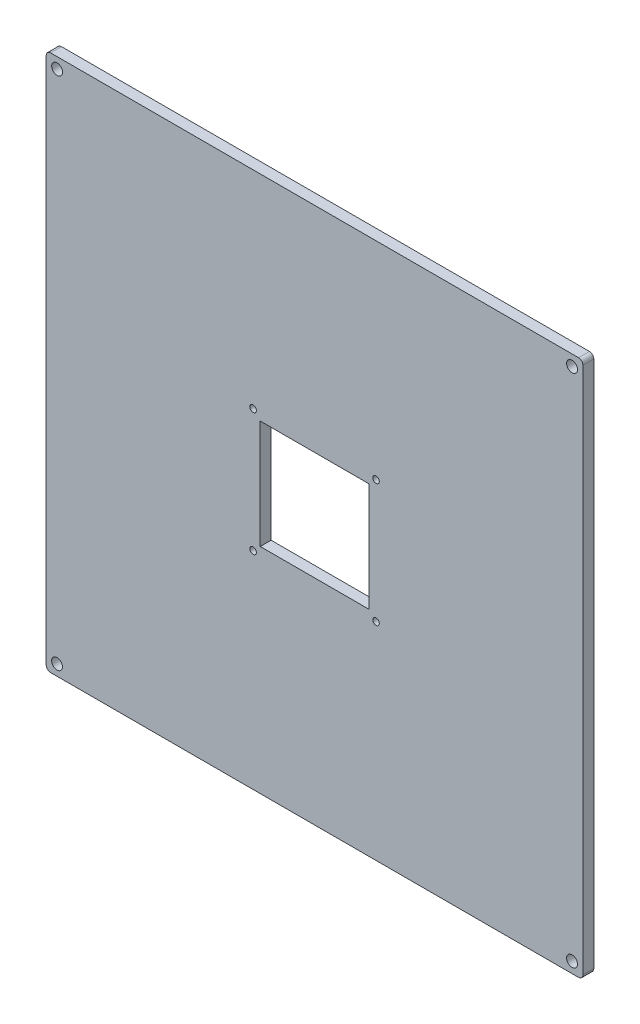
ISO-10303-21;
HEADER;
FILE_DESCRIPTION(('STEP AP214'),'2;1');
FILE_NAME('part.step','',(''),(''),'','','');
FILE_SCHEMA(('AUTOMOTIVE_DESIGN { 1 0 10303 214 1 1 1 1 }'));
ENDSEC;
DATA;
#1=APPLICATION_CONTEXT('core data for automotive mechanical design processes');
#2=APPLICATION_PROTOCOL_DEFINITION('international standard','automotive_design',2000,#1);
#3=PRODUCT_CONTEXT('',#1,'mechanical');
#4=PRODUCT('Part','Part','',(#3));
#5=PRODUCT_RELATED_PRODUCT_CATEGORY('part','',(#4));
#6=PRODUCT_DEFINITION_FORMATION('','',#4);
#7=PRODUCT_DEFINITION_CONTEXT('part definition',#1,'design');
#8=PRODUCT_DEFINITION('design','',#6,#7);
#9=PRODUCT_DEFINITION_SHAPE('','',#8);
#10=(LENGTH_UNIT() NAMED_UNIT(*) SI_UNIT(.MILLI.,.METRE.));
#11=(NAMED_UNIT(*) PLANE_ANGLE_UNIT() SI_UNIT($,.RADIAN.));
#12=(NAMED_UNIT(*) SI_UNIT($,.STERADIAN.) SOLID_ANGLE_UNIT());
#13=UNCERTAINTY_MEASURE_WITH_UNIT(LENGTH_MEASURE(1.E-05),#10,'distance_accuracy_value','');
#14=(GEOMETRIC_REPRESENTATION_CONTEXT(3) GLOBAL_UNCERTAINTY_ASSIGNED_CONTEXT((#13)) GLOBAL_UNIT_ASSIGNED_CONTEXT((#10,
#11,#12)) REPRESENTATION_CONTEXT('',''));
#15=CARTESIAN_POINT('',(0.,0.,0.));
#16=DIRECTION('',(0.,0.,1.));
#17=DIRECTION('',(1.,0.,0.));
#18=AXIS2_PLACEMENT_3D('',#15,#16,#17);
#19=CARTESIAN_POINT('',(-121.5,-121.5,5.));
#20=DIRECTION('',(0.,0.,1.));
#21=DIRECTION('',(1.,0.,0.));
#22=AXIS2_PLACEMENT_3D('',#19,#20,#21);
#23=PLANE('',#22);
#24=CARTESIAN_POINT('',(28.2842712474618,28.284271247462,5.));
#25=DIRECTION('',(0.,0.,-1.));
#26=DIRECTION('',(1.,0.,0.));
#27=AXIS2_PLACEMENT_3D('',#24,#25,#26);
#28=CIRCLE('',#27,1.5);
#29=CARTESIAN_POINT('',(29.7842712474619,28.284271247462,5.));
#30=VERTEX_POINT('',#29);
#31=EDGE_CURVE('E381',#30,#30,#28,.T.);
#32=ORIENTED_EDGE('',*,*,#31,.T.);
#33=EDGE_LOOP('',(#32));
#34=FACE_BOUND('',#33,.T.);
#35=CARTESIAN_POINT('',(28.2842712474618,-28.284271247462,5.));
#36=DIRECTION('',(0.,0.,-1.));
#37=DIRECTION('',(-1.,0.,0.));
#38=AXIS2_PLACEMENT_3D('',#35,#36,#37);
#39=CIRCLE('',#38,1.5);
#40=CARTESIAN_POINT('',(26.7842712474618,-28.284271247462,5.));
#41=VERTEX_POINT('',#40);
#42=EDGE_CURVE('E376',#41,#41,#39,.T.);
#43=ORIENTED_EDGE('',*,*,#42,.T.);
#44=EDGE_LOOP('',(#43));
#45=FACE_BOUND('',#44,.T.);
#46=CARTESIAN_POINT('',(-28.2842712474618,-28.284271247462,5.));
#47=DIRECTION('',(0.,0.,-1.));
#48=DIRECTION('',(1.,0.,0.));
#49=AXIS2_PLACEMENT_3D('',#46,#47,#48);
#50=CIRCLE('',#49,1.5);
#51=CARTESIAN_POINT('',(-26.7842712474618,-28.284271247462,5.));
#52=VERTEX_POINT('',#51);
#53=EDGE_CURVE('E367',#52,#52,#50,.T.);
#54=ORIENTED_EDGE('',*,*,#53,.T.);
#55=EDGE_LOOP('',(#54));
#56=FACE_BOUND('',#55,.T.);
#57=CARTESIAN_POINT('',(-28.2842712474618,28.284271247462,5.));
#58=DIRECTION('',(0.,0.,-1.));
#59=DIRECTION('',(-1.,0.,0.));
#60=AXIS2_PLACEMENT_3D('',#57,#58,#59);
#61=CIRCLE('',#60,1.5);
#62=CARTESIAN_POINT('',(-29.7842712474619,28.284271247462,5.));
#63=VERTEX_POINT('',#62);
#64=EDGE_CURVE('E152',#63,#63,#61,.T.);
#65=ORIENTED_EDGE('',*,*,#64,.T.);
#66=EDGE_LOOP('',(#65));
#67=FACE_BOUND('',#66,.T.);
#68=DIRECTION('',(1.,0.,0.));
#69=VECTOR('',#68,1.);
#70=CARTESIAN_POINT('',(-25.,25.,5.));
#71=LINE('',#70,#69);
#72=CARTESIAN_POINT('',(-25.,25.,5.));
#73=VERTEX_POINT('',#72);
#74=CARTESIAN_POINT('',(25.,25.,5.));
#75=VERTEX_POINT('',#74);
#76=EDGE_CURVE('E124',#73,#75,#71,.T.);
#77=ORIENTED_EDGE('',*,*,#76,.T.);
#78=DIRECTION('',(0.,-1.,0.));
#79=VECTOR('',#78,1.);
#80=CARTESIAN_POINT('',(25.,25.,5.));
#81=LINE('',#80,#79);
#82=CARTESIAN_POINT('',(25.,-25.,5.));
#83=VERTEX_POINT('',#82);
#84=EDGE_CURVE('E133',#75,#83,#81,.T.);
#85=ORIENTED_EDGE('',*,*,#84,.T.);
#86=DIRECTION('',(-1.,0.,0.));
#87=VECTOR('',#86,1.);
#88=CARTESIAN_POINT('',(25.,-25.,5.));
#89=LINE('',#88,#87);
#90=CARTESIAN_POINT('',(-25.,-25.,5.));
#91=VERTEX_POINT('',#90);
#92=EDGE_CURVE('E48',#83,#91,#89,.T.);
#93=ORIENTED_EDGE('',*,*,#92,.T.);
#94=DIRECTION('',(0.,1.,0.));
#95=VECTOR('',#94,1.);
#96=CARTESIAN_POINT('',(-25.,-25.,5.));
#97=LINE('',#96,#95);
#98=EDGE_CURVE('E130',#91,#73,#97,.T.);
#99=ORIENTED_EDGE('',*,*,#98,.T.);
#100=EDGE_LOOP('',(#77,#85,#93,#99));
#101=FACE_BOUND('',#100,.T.);
#102=CARTESIAN_POINT('',(118.5,-118.5,5.));
#103=DIRECTION('',(0.,0.,1.));
#104=DIRECTION('',(1.,0.,0.));
#105=AXIS2_PLACEMENT_3D('',#102,#103,#104);
#106=CIRCLE('',#105,2.5);
#107=CARTESIAN_POINT('',(121.,-118.5,5.));
#108=VERTEX_POINT('',#107);
#109=EDGE_CURVE('E168',#108,#108,#106,.T.);
#110=ORIENTED_EDGE('',*,*,#109,.F.);
#111=EDGE_LOOP('',(#110));
#112=FACE_BOUND('',#111,.T.);
#113=CARTESIAN_POINT('',(-118.5,118.5,5.));
#114=DIRECTION('',(0.,0.,1.));
#115=DIRECTION('',(1.,0.,0.));
#116=AXIS2_PLACEMENT_3D('',#113,#114,#115);
#117=CIRCLE('',#116,2.5);
#118=CARTESIAN_POINT('',(-116.,118.5,5.));
#119=VERTEX_POINT('',#118);
#120=EDGE_CURVE('E180',#119,#119,#117,.T.);
#121=ORIENTED_EDGE('',*,*,#120,.F.);
#122=EDGE_LOOP('',(#121));
#123=FACE_BOUND('',#122,.T.);
#124=CARTESIAN_POINT('',(-121.5,-121.5,5.));
#125=DIRECTION('',(0.,0.,1.));
#126=DIRECTION('',(1.,0.,0.));
#127=AXIS2_PLACEMENT_3D('',#124,#125,#126);
#128=CIRCLE('',#127,2.);
#129=CARTESIAN_POINT('',(-123.5,-121.5,5.));
#130=VERTEX_POINT('',#129);
#131=CARTESIAN_POINT('',(-121.5,-123.5,5.));
#132=VERTEX_POINT('',#131);
#133=EDGE_CURVE('E186',#130,#132,#128,.T.);
#134=ORIENTED_EDGE('',*,*,#133,.T.);
#135=DIRECTION('',(1.,0.,0.));
#136=VECTOR('',#135,1.);
#137=CARTESIAN_POINT('',(-121.5,-123.5,5.));
#138=LINE('',#137,#136);
#139=CARTESIAN_POINT('',(121.5,-123.5,5.));
#140=VERTEX_POINT('',#139);
#141=EDGE_CURVE('E189',#132,#140,#138,.T.);
#142=ORIENTED_EDGE('',*,*,#141,.T.);
#143=CARTESIAN_POINT('',(121.5,-121.5,5.));
#144=DIRECTION('',(0.,0.,1.));
#145=DIRECTION('',(1.,0.,0.));
#146=AXIS2_PLACEMENT_3D('',#143,#144,#145);
#147=CIRCLE('',#146,2.);
#148=CARTESIAN_POINT('',(123.5,-121.5,5.));
#149=VERTEX_POINT('',#148);
#150=EDGE_CURVE('E192',#140,#149,#147,.T.);
#151=ORIENTED_EDGE('',*,*,#150,.T.);
#152=DIRECTION('',(0.,1.,0.));
#153=VECTOR('',#152,1.);
#154=CARTESIAN_POINT('',(123.5,-121.5,5.));
#155=LINE('',#154,#153);
#156=CARTESIAN_POINT('',(123.5,121.5,5.));
#157=VERTEX_POINT('',#156);
#158=EDGE_CURVE('E194',#149,#157,#155,.T.);
#159=ORIENTED_EDGE('',*,*,#158,.T.);
#160=CARTESIAN_POINT('',(121.5,121.5,5.));
#161=DIRECTION('',(0.,0.,1.));
#162=DIRECTION('',(1.,0.,0.));
#163=AXIS2_PLACEMENT_3D('',#160,#161,#162);
#164=CIRCLE('',#163,2.);
#165=CARTESIAN_POINT('',(121.5,123.5,5.));
#166=VERTEX_POINT('',#165);
#167=EDGE_CURVE('E196',#157,#166,#164,.T.);
#168=ORIENTED_EDGE('',*,*,#167,.T.);
#169=DIRECTION('',(-1.,0.,0.));
#170=VECTOR('',#169,1.);
#171=CARTESIAN_POINT('',(121.5,123.5,5.));
#172=LINE('',#171,#170);
#173=CARTESIAN_POINT('',(-121.5,123.5,5.));
#174=VERTEX_POINT('',#173);
#175=EDGE_CURVE('E198',#166,#174,#172,.T.);
#176=ORIENTED_EDGE('',*,*,#175,.T.);
#177=CARTESIAN_POINT('',(-121.5,121.5,5.));
#178=DIRECTION('',(0.,0.,1.));
#179=DIRECTION('',(-1.,0.,0.));
#180=AXIS2_PLACEMENT_3D('',#177,#178,#179);
#181=CIRCLE('',#180,2.);
#182=CARTESIAN_POINT('',(-123.5,121.5,5.));
#183=VERTEX_POINT('',#182);
#184=EDGE_CURVE('E200',#174,#183,#181,.T.);
#185=ORIENTED_EDGE('',*,*,#184,.T.);
#186=DIRECTION('',(0.,-1.,0.));
#187=VECTOR('',#186,1.);
#188=CARTESIAN_POINT('',(-123.5,121.5,5.));
#189=LINE('',#188,#187);
#190=EDGE_CURVE('E202',#183,#130,#189,.T.);
#191=ORIENTED_EDGE('',*,*,#190,.T.);
#192=EDGE_LOOP('',(#134,#142,#151,#159,#168,#176,#185,#191));
#193=FACE_BOUND('',#192,.T.);
#194=CARTESIAN_POINT('',(118.5,118.5,5.));
#195=DIRECTION('',(0.,0.,1.));
#196=DIRECTION('',(-1.,0.,0.));
#197=AXIS2_PLACEMENT_3D('',#194,#195,#196);
#198=CIRCLE('',#197,2.5);
#199=CARTESIAN_POINT('',(116.,118.5,5.));
#200=VERTEX_POINT('',#199);
#201=EDGE_CURVE('E174',#200,#200,#198,.T.);
#202=ORIENTED_EDGE('',*,*,#201,.F.);
#203=EDGE_LOOP('',(#202));
#204=FACE_BOUND('',#203,.T.);
#205=CARTESIAN_POINT('',(-118.5,-118.5,5.));
#206=DIRECTION('',(0.,0.,1.));
#207=DIRECTION('',(-1.,0.,0.));
#208=AXIS2_PLACEMENT_3D('',#205,#206,#207);
#209=CIRCLE('',#208,2.5);
#210=CARTESIAN_POINT('',(-121.,-118.5,5.));
#211=VERTEX_POINT('',#210);
#212=EDGE_CURVE('E162',#211,#211,#209,.T.);
#213=ORIENTED_EDGE('',*,*,#212,.F.);
#214=EDGE_LOOP('',(#213));
#215=FACE_BOUND('',#214,.T.);
#216=ADVANCED_FACE('F33',(#34,#45,#56,#67,#101,#112,#123,#193,#204,#215),#23,.T.);
#217=CARTESIAN_POINT('',(-121.5,-121.5,0.));
#218=DIRECTION('',(0.,0.,1.));
#219=DIRECTION('',(1.,0.,0.));
#220=AXIS2_PLACEMENT_3D('',#217,#218,#219);
#221=PLANE('',#220);
#222=CARTESIAN_POINT('',(28.2842712474618,28.284271247462,0.));
#223=DIRECTION('',(0.,0.,-1.));
#224=DIRECTION('',(1.,0.,0.));
#225=AXIS2_PLACEMENT_3D('',#222,#223,#224);
#226=CIRCLE('',#225,1.5);
#227=CARTESIAN_POINT('',(29.7842712474619,28.284271247462,0.));
#228=VERTEX_POINT('',#227);
#229=EDGE_CURVE('E145',#228,#228,#226,.T.);
#230=ORIENTED_EDGE('',*,*,#229,.F.);
#231=EDGE_LOOP('',(#230));
#232=FACE_BOUND('',#231,.T.);
#233=CARTESIAN_POINT('',(28.2842712474618,-28.284271247462,0.));
#234=DIRECTION('',(0.,0.,-1.));
#235=DIRECTION('',(-1.,0.,0.));
#236=AXIS2_PLACEMENT_3D('',#233,#234,#235);
#237=CIRCLE('',#236,1.5);
#238=CARTESIAN_POINT('',(26.7842712474618,-28.284271247462,0.));
#239=VERTEX_POINT('',#238);
#240=EDGE_CURVE('E379',#239,#239,#237,.T.);
#241=ORIENTED_EDGE('',*,*,#240,.F.);
#242=EDGE_LOOP('',(#241));
#243=FACE_BOUND('',#242,.T.);
#244=CARTESIAN_POINT('',(-28.2842712474618,-28.284271247462,0.));
#245=DIRECTION('',(0.,0.,-1.));
#246=DIRECTION('',(1.,0.,0.));
#247=AXIS2_PLACEMENT_3D('',#244,#245,#246);
#248=CIRCLE('',#247,1.5);
#249=CARTESIAN_POINT('',(-26.7842712474618,-28.284271247462,0.));
#250=VERTEX_POINT('',#249);
#251=EDGE_CURVE('E371',#250,#250,#248,.T.);
#252=ORIENTED_EDGE('',*,*,#251,.F.);
#253=EDGE_LOOP('',(#252));
#254=FACE_BOUND('',#253,.T.);
#255=CARTESIAN_POINT('',(-28.2842712474618,28.284271247462,0.));
#256=DIRECTION('',(0.,0.,-1.));
#257=DIRECTION('',(-1.,0.,0.));
#258=AXIS2_PLACEMENT_3D('',#255,#256,#257);
#259=CIRCLE('',#258,1.5);
#260=CARTESIAN_POINT('',(-29.7842712474619,28.284271247462,0.));
#261=VERTEX_POINT('',#260);
#262=EDGE_CURVE('E365',#261,#261,#259,.T.);
#263=ORIENTED_EDGE('',*,*,#262,.F.);
#264=EDGE_LOOP('',(#263));
#265=FACE_BOUND('',#264,.T.);
#266=DIRECTION('',(0.,-1.,0.));
#267=VECTOR('',#266,1.);
#268=CARTESIAN_POINT('',(25.,25.,0.));
#269=LINE('',#268,#267);
#270=CARTESIAN_POINT('',(25.,25.,0.));
#271=VERTEX_POINT('',#270);
#272=CARTESIAN_POINT('',(25.,-25.,0.));
#273=VERTEX_POINT('',#272);
#274=EDGE_CURVE('E151',#271,#273,#269,.T.);
#275=ORIENTED_EDGE('',*,*,#274,.F.);
#276=DIRECTION('',(1.,0.,0.));
#277=VECTOR('',#276,1.);
#278=CARTESIAN_POINT('',(-25.,25.,0.));
#279=LINE('',#278,#277);
#280=CARTESIAN_POINT('',(-25.,25.,0.));
#281=VERTEX_POINT('',#280);
#282=EDGE_CURVE('E56',#281,#271,#279,.T.);
#283=ORIENTED_EDGE('',*,*,#282,.F.);
#284=DIRECTION('',(0.,1.,0.));
#285=VECTOR('',#284,1.);
#286=CARTESIAN_POINT('',(-25.,-25.,0.));
#287=LINE('',#286,#285);
#288=CARTESIAN_POINT('',(-25.,-25.,0.));
#289=VERTEX_POINT('',#288);
#290=EDGE_CURVE('E139',#289,#281,#287,.T.);
#291=ORIENTED_EDGE('',*,*,#290,.F.);
#292=DIRECTION('',(-1.,0.,0.));
#293=VECTOR('',#292,1.);
#294=CARTESIAN_POINT('',(25.,-25.,0.));
#295=LINE('',#294,#293);
#296=EDGE_CURVE('E142',#273,#289,#295,.T.);
#297=ORIENTED_EDGE('',*,*,#296,.F.);
#298=EDGE_LOOP('',(#275,#283,#291,#297));
#299=FACE_BOUND('',#298,.T.);
#300=CARTESIAN_POINT('',(-121.5,-121.5,0.));
#301=DIRECTION('',(0.,0.,1.));
#302=DIRECTION('',(1.,0.,0.));
#303=AXIS2_PLACEMENT_3D('',#300,#301,#302);
#304=CIRCLE('',#303,2.);
#305=CARTESIAN_POINT('',(-123.5,-121.5,0.));
#306=VERTEX_POINT('',#305);
#307=CARTESIAN_POINT('',(-121.5,-123.5,0.));
#308=VERTEX_POINT('',#307);
#309=EDGE_CURVE('E183',#306,#308,#304,.T.);
#310=ORIENTED_EDGE('',*,*,#309,.F.);
#311=DIRECTION('',(0.,-1.,0.));
#312=VECTOR('',#311,1.);
#313=CARTESIAN_POINT('',(-123.5,121.5,0.));
#314=LINE('',#313,#312);
#315=CARTESIAN_POINT('',(-123.5,121.5,0.));
#316=VERTEX_POINT('',#315);
#317=EDGE_CURVE('E190',#316,#306,#314,.T.);
#318=ORIENTED_EDGE('',*,*,#317,.F.);
#319=CARTESIAN_POINT('',(-121.5,121.5,0.));
#320=DIRECTION('',(0.,0.,1.));
#321=DIRECTION('',(-1.,0.,0.));
#322=AXIS2_PLACEMENT_3D('',#319,#320,#321);
#323=CIRCLE('',#322,2.);
#324=CARTESIAN_POINT('',(-121.5,123.5,0.));
#325=VERTEX_POINT('',#324);
#326=EDGE_CURVE('E217',#325,#316,#323,.T.);
#327=ORIENTED_EDGE('',*,*,#326,.F.);
#328=DIRECTION('',(-1.,0.,0.));
#329=VECTOR('',#328,1.);
#330=CARTESIAN_POINT('',(121.5,123.5,0.));
#331=LINE('',#330,#329);
#332=CARTESIAN_POINT('',(121.5,123.5,0.));
#333=VERTEX_POINT('',#332);
#334=EDGE_CURVE('E215',#333,#325,#331,.T.);
#335=ORIENTED_EDGE('',*,*,#334,.F.);
#336=CARTESIAN_POINT('',(121.5,121.5,0.));
#337=DIRECTION('',(0.,0.,1.));
#338=DIRECTION('',(1.,0.,0.));
#339=AXIS2_PLACEMENT_3D('',#336,#337,#338);
#340=CIRCLE('',#339,2.);
#341=CARTESIAN_POINT('',(123.5,121.5,0.));
#342=VERTEX_POINT('',#341);
#343=EDGE_CURVE('E213',#342,#333,#340,.T.);
#344=ORIENTED_EDGE('',*,*,#343,.F.);
#345=DIRECTION('',(0.,1.,0.));
#346=VECTOR('',#345,1.);
#347=CARTESIAN_POINT('',(123.5,-121.5,0.));
#348=LINE('',#347,#346);
#349=CARTESIAN_POINT('',(123.5,-121.5,0.));
#350=VERTEX_POINT('',#349);
#351=EDGE_CURVE('E211',#350,#342,#348,.T.);
#352=ORIENTED_EDGE('',*,*,#351,.F.);
#353=CARTESIAN_POINT('',(121.5,-121.5,0.));
#354=DIRECTION('',(0.,0.,1.));
#355=DIRECTION('',(1.,0.,0.));
#356=AXIS2_PLACEMENT_3D('',#353,#354,#355);
#357=CIRCLE('',#356,2.);
#358=CARTESIAN_POINT('',(121.5,-123.5,0.));
#359=VERTEX_POINT('',#358);
#360=EDGE_CURVE('E209',#359,#350,#357,.T.);
#361=ORIENTED_EDGE('',*,*,#360,.F.);
#362=DIRECTION('',(1.,0.,0.));
#363=VECTOR('',#362,1.);
#364=CARTESIAN_POINT('',(-121.5,-123.5,0.));
#365=LINE('',#364,#363);
#366=EDGE_CURVE('E207',#308,#359,#365,.T.);
#367=ORIENTED_EDGE('',*,*,#366,.F.);
#368=EDGE_LOOP('',(#310,#318,#327,#335,#344,#352,#361,#367));
#369=FACE_BOUND('',#368,.T.);
#370=CARTESIAN_POINT('',(-118.5,118.5,0.));
#371=DIRECTION('',(0.,0.,1.));
#372=DIRECTION('',(1.,0.,0.));
#373=AXIS2_PLACEMENT_3D('',#370,#371,#372);
#374=CIRCLE('',#373,2.5);
#375=CARTESIAN_POINT('',(-116.,118.5,0.));
#376=VERTEX_POINT('',#375);
#377=EDGE_CURVE('E177',#376,#376,#374,.T.);
#378=ORIENTED_EDGE('',*,*,#377,.T.);
#379=EDGE_LOOP('',(#378));
#380=FACE_BOUND('',#379,.T.);
#381=CARTESIAN_POINT('',(118.5,118.5,0.));
#382=DIRECTION('',(0.,0.,1.));
#383=DIRECTION('',(-1.,0.,0.));
#384=AXIS2_PLACEMENT_3D('',#381,#382,#383);
#385=CIRCLE('',#384,2.5);
#386=CARTESIAN_POINT('',(116.,118.5,0.));
#387=VERTEX_POINT('',#386);
#388=EDGE_CURVE('E171',#387,#387,#385,.T.);
#389=ORIENTED_EDGE('',*,*,#388,.T.);
#390=EDGE_LOOP('',(#389));
#391=FACE_BOUND('',#390,.T.);
#392=CARTESIAN_POINT('',(118.5,-118.5,0.));
#393=DIRECTION('',(0.,0.,1.));
#394=DIRECTION('',(1.,0.,0.));
#395=AXIS2_PLACEMENT_3D('',#392,#393,#394);
#396=CIRCLE('',#395,2.5);
#397=CARTESIAN_POINT('',(121.,-118.5,0.));
#398=VERTEX_POINT('',#397);
#399=EDGE_CURVE('E165',#398,#398,#396,.T.);
#400=ORIENTED_EDGE('',*,*,#399,.T.);
#401=EDGE_LOOP('',(#400));
#402=FACE_BOUND('',#401,.T.);
#403=CARTESIAN_POINT('',(-118.5,-118.5,0.));
#404=DIRECTION('',(0.,0.,1.));
#405=DIRECTION('',(-1.,0.,0.));
#406=AXIS2_PLACEMENT_3D('',#403,#404,#405);
#407=CIRCLE('',#406,2.5);
#408=CARTESIAN_POINT('',(-121.,-118.5,0.));
#409=VERTEX_POINT('',#408);
#410=EDGE_CURVE('E158',#409,#409,#407,.T.);
#411=ORIENTED_EDGE('',*,*,#410,.T.);
#412=EDGE_LOOP('',(#411));
#413=FACE_BOUND('',#412,.T.);
#414=ADVANCED_FACE('F247',(#232,#243,#254,#265,#299,#369,#380,#391,#402,#413),#221,.F.);
#415=CARTESIAN_POINT('',(-121.5,-121.5,5.));
#416=DIRECTION('',(0.,0.,-1.));
#417=DIRECTION('',(-1.,0.,0.));
#418=AXIS2_PLACEMENT_3D('',#415,#416,#417);
#419=CYLINDRICAL_SURFACE('',#418,2.);
#420=ORIENTED_EDGE('',*,*,#309,.T.);
#421=DIRECTION('',(0.,0.,-1.));
#422=VECTOR('',#421,1.);
#423=CARTESIAN_POINT('',(-121.5,-123.5,5.));
#424=LINE('',#423,#422);
#425=EDGE_CURVE('E11',#132,#308,#424,.T.);
#426=ORIENTED_EDGE('',*,*,#425,.F.);
#427=ORIENTED_EDGE('',*,*,#133,.F.);
#428=DIRECTION('',(0.,0.,-1.));
#429=VECTOR('',#428,1.);
#430=CARTESIAN_POINT('',(-123.5,-121.5,5.));
#431=LINE('',#430,#429);
#432=EDGE_CURVE('E204',#130,#306,#431,.T.);
#433=ORIENTED_EDGE('',*,*,#432,.T.);
#434=EDGE_LOOP('',(#420,#426,#427,#433));
#435=FACE_BOUND('',#434,.T.);
#436=ADVANCED_FACE('F35',(#435),#419,.T.);
#437=CARTESIAN_POINT('',(-121.5,-123.5,5.));
#438=DIRECTION('',(0.,1.,0.));
#439=DIRECTION('',(-1.,0.,0.));
#440=AXIS2_PLACEMENT_3D('',#437,#438,#439);
#441=PLANE('',#440);
#442=ORIENTED_EDGE('',*,*,#366,.T.);
#443=DIRECTION('',(0.,0.,-1.));
#444=VECTOR('',#443,1.);
#445=CARTESIAN_POINT('',(121.5,-123.5,5.));
#446=LINE('',#445,#444);
#447=EDGE_CURVE('E41',#140,#359,#446,.T.);
#448=ORIENTED_EDGE('',*,*,#447,.F.);
#449=ORIENTED_EDGE('',*,*,#141,.F.);
#450=ORIENTED_EDGE('',*,*,#425,.T.);
#451=EDGE_LOOP('',(#442,#448,#449,#450));
#452=FACE_BOUND('',#451,.T.);
#453=ADVANCED_FACE('F265',(#452),#441,.F.);
#454=CARTESIAN_POINT('',(121.5,-121.5,5.));
#455=DIRECTION('',(0.,0.,-1.));
#456=DIRECTION('',(-1.,0.,0.));
#457=AXIS2_PLACEMENT_3D('',#454,#455,#456);
#458=CYLINDRICAL_SURFACE('',#457,2.);
#459=ORIENTED_EDGE('',*,*,#360,.T.);
#460=DIRECTION('',(0.,0.,-1.));
#461=VECTOR('',#460,1.);
#462=CARTESIAN_POINT('',(123.5,-121.5,5.));
#463=LINE('',#462,#461);
#464=EDGE_CURVE('E234',#149,#350,#463,.T.);
#465=ORIENTED_EDGE('',*,*,#464,.F.);
#466=ORIENTED_EDGE('',*,*,#150,.F.);
#467=ORIENTED_EDGE('',*,*,#447,.T.);
#468=EDGE_LOOP('',(#459,#465,#466,#467));
#469=FACE_BOUND('',#468,.T.);
#470=ADVANCED_FACE('F241',(#469),#458,.T.);
#471=CARTESIAN_POINT('',(123.5,-121.5,5.));
#472=DIRECTION('',(-1.,0.,0.));
#473=DIRECTION('',(0.,0.,1.));
#474=AXIS2_PLACEMENT_3D('',#471,#472,#473);
#475=PLANE('',#474);
#476=ORIENTED_EDGE('',*,*,#351,.T.);
#477=DIRECTION('',(0.,0.,-1.));
#478=VECTOR('',#477,1.);
#479=CARTESIAN_POINT('',(123.5,121.5,5.));
#480=LINE('',#479,#478);
#481=EDGE_CURVE('E231',#157,#342,#480,.T.);
#482=ORIENTED_EDGE('',*,*,#481,.F.);
#483=ORIENTED_EDGE('',*,*,#158,.F.);
#484=ORIENTED_EDGE('',*,*,#464,.T.);
#485=EDGE_LOOP('',(#476,#482,#483,#484));
#486=FACE_BOUND('',#485,.T.);
#487=ADVANCED_FACE('F253',(#486),#475,.F.);
#488=CARTESIAN_POINT('',(121.5,121.5,5.));
#489=DIRECTION('',(0.,0.,-1.));
#490=DIRECTION('',(-1.,0.,0.));
#491=AXIS2_PLACEMENT_3D('',#488,#489,#490);
#492=CYLINDRICAL_SURFACE('',#491,2.);
#493=ORIENTED_EDGE('',*,*,#343,.T.);
#494=DIRECTION('',(0.,0.,-1.));
#495=VECTOR('',#494,1.);
#496=CARTESIAN_POINT('',(121.5,123.5,5.));
#497=LINE('',#496,#495);
#498=EDGE_CURVE('E228',#166,#333,#497,.T.);
#499=ORIENTED_EDGE('',*,*,#498,.F.);
#500=ORIENTED_EDGE('',*,*,#167,.F.);
#501=ORIENTED_EDGE('',*,*,#481,.T.);
#502=EDGE_LOOP('',(#493,#499,#500,#501));
#503=FACE_BOUND('',#502,.T.);
#504=ADVANCED_FACE('F257',(#503),#492,.T.);
#505=CARTESIAN_POINT('',(121.5,123.5,5.));
#506=DIRECTION('',(0.,-1.,0.));
#507=DIRECTION('',(1.,0.,0.));
#508=AXIS2_PLACEMENT_3D('',#505,#506,#507);
#509=PLANE('',#508);
#510=ORIENTED_EDGE('',*,*,#334,.T.);
#511=DIRECTION('',(0.,0.,-1.));
#512=VECTOR('',#511,1.);
#513=CARTESIAN_POINT('',(-121.5,123.5,5.));
#514=LINE('',#513,#512);
#515=EDGE_CURVE('E225',#174,#325,#514,.T.);
#516=ORIENTED_EDGE('',*,*,#515,.F.);
#517=ORIENTED_EDGE('',*,*,#175,.F.);
#518=ORIENTED_EDGE('',*,*,#498,.T.);
#519=EDGE_LOOP('',(#510,#516,#517,#518));
#520=FACE_BOUND('',#519,.T.);
#521=ADVANCED_FACE('F278',(#520),#509,.F.);
#522=CARTESIAN_POINT('',(-121.5,121.5,5.));
#523=DIRECTION('',(0.,0.,-1.));
#524=DIRECTION('',(-1.,0.,0.));
#525=AXIS2_PLACEMENT_3D('',#522,#523,#524);
#526=CYLINDRICAL_SURFACE('',#525,2.);
#527=ORIENTED_EDGE('',*,*,#326,.T.);
#528=DIRECTION('',(0.,0.,-1.));
#529=VECTOR('',#528,1.);
#530=CARTESIAN_POINT('',(-123.5,121.5,5.));
#531=LINE('',#530,#529);
#532=EDGE_CURVE('E222',#183,#316,#531,.T.);
#533=ORIENTED_EDGE('',*,*,#532,.F.);
#534=ORIENTED_EDGE('',*,*,#184,.F.);
#535=ORIENTED_EDGE('',*,*,#515,.T.);
#536=EDGE_LOOP('',(#527,#533,#534,#535));
#537=FACE_BOUND('',#536,.T.);
#538=ADVANCED_FACE('F276',(#537),#526,.T.);
#539=CARTESIAN_POINT('',(-123.5,121.5,5.));
#540=DIRECTION('',(1.,0.,0.));
#541=DIRECTION('',(0.,1.,0.));
#542=AXIS2_PLACEMENT_3D('',#539,#540,#541);
#543=PLANE('',#542);
#544=ORIENTED_EDGE('',*,*,#317,.T.);
#545=ORIENTED_EDGE('',*,*,#432,.F.);
#546=ORIENTED_EDGE('',*,*,#190,.F.);
#547=ORIENTED_EDGE('',*,*,#532,.T.);
#548=EDGE_LOOP('',(#544,#545,#546,#547));
#549=FACE_BOUND('',#548,.T.);
#550=ADVANCED_FACE('F271',(#549),#543,.F.);
#551=CARTESIAN_POINT('',(-118.5,118.5,5.));
#552=DIRECTION('',(0.,0.,-1.));
#553=DIRECTION('',(-1.,0.,0.));
#554=AXIS2_PLACEMENT_3D('',#551,#552,#553);
#555=CYLINDRICAL_SURFACE('',#554,2.5);
#556=ORIENTED_EDGE('',*,*,#120,.T.);
#557=EDGE_LOOP('',(#556));
#558=FACE_BOUND('',#557,.T.);
#559=ORIENTED_EDGE('',*,*,#377,.F.);
#560=EDGE_LOOP('',(#559));
#561=FACE_BOUND('',#560,.T.);
#562=ADVANCED_FACE('F299',(#558,#561),#555,.F.);
#563=CARTESIAN_POINT('',(118.5,118.5,5.));
#564=DIRECTION('',(0.,0.,-1.));
#565=DIRECTION('',(-1.,0.,0.));
#566=AXIS2_PLACEMENT_3D('',#563,#564,#565);
#567=CYLINDRICAL_SURFACE('',#566,2.5);
#568=ORIENTED_EDGE('',*,*,#201,.T.);
#569=EDGE_LOOP('',(#568));
#570=FACE_BOUND('',#569,.T.);
#571=ORIENTED_EDGE('',*,*,#388,.F.);
#572=EDGE_LOOP('',(#571));
#573=FACE_BOUND('',#572,.T.);
#574=ADVANCED_FACE('F306',(#570,#573),#567,.F.);
#575=CARTESIAN_POINT('',(118.5,-118.5,5.));
#576=DIRECTION('',(0.,0.,-1.));
#577=DIRECTION('',(-1.,0.,0.));
#578=AXIS2_PLACEMENT_3D('',#575,#576,#577);
#579=CYLINDRICAL_SURFACE('',#578,2.5);
#580=ORIENTED_EDGE('',*,*,#109,.T.);
#581=EDGE_LOOP('',(#580));
#582=FACE_BOUND('',#581,.T.);
#583=ORIENTED_EDGE('',*,*,#399,.F.);
#584=EDGE_LOOP('',(#583));
#585=FACE_BOUND('',#584,.T.);
#586=ADVANCED_FACE('F311',(#582,#585),#579,.F.);
#587=CARTESIAN_POINT('',(-118.5,-118.5,5.));
#588=DIRECTION('',(0.,0.,-1.));
#589=DIRECTION('',(-1.,0.,0.));
#590=AXIS2_PLACEMENT_3D('',#587,#588,#589);
#591=CYLINDRICAL_SURFACE('',#590,2.5);
#592=ORIENTED_EDGE('',*,*,#212,.T.);
#593=EDGE_LOOP('',(#592));
#594=FACE_BOUND('',#593,.T.);
#595=ORIENTED_EDGE('',*,*,#410,.F.);
#596=EDGE_LOOP('',(#595));
#597=FACE_BOUND('',#596,.T.);
#598=ADVANCED_FACE('F323',(#594,#597),#591,.F.);
#599=CARTESIAN_POINT('',(-25.,25.,5.));
#600=DIRECTION('',(0.,1.,0.));
#601=DIRECTION('',(-1.,0.,0.));
#602=AXIS2_PLACEMENT_3D('',#599,#600,#601);
#603=PLANE('',#602);
#604=ORIENTED_EDGE('',*,*,#282,.T.);
#605=DIRECTION('',(0.,0.,-1.));
#606=VECTOR('',#605,1.);
#607=CARTESIAN_POINT('',(25.,25.,5.));
#608=LINE('',#607,#606);
#609=EDGE_CURVE('E120',#75,#271,#608,.T.);
#610=ORIENTED_EDGE('',*,*,#609,.F.);
#611=ORIENTED_EDGE('',*,*,#76,.F.);
#612=DIRECTION('',(0.,0.,-1.));
#613=VECTOR('',#612,1.);
#614=CARTESIAN_POINT('',(-25.,25.,5.));
#615=LINE('',#614,#613);
#616=EDGE_CURVE('E156',#73,#281,#615,.T.);
#617=ORIENTED_EDGE('',*,*,#616,.T.);
#618=EDGE_LOOP('',(#604,#610,#611,#617));
#619=FACE_BOUND('',#618,.T.);
#620=ADVANCED_FACE('F122',(#619),#603,.F.);
#621=CARTESIAN_POINT('',(-25.,-25.,5.));
#622=DIRECTION('',(-1.,0.,0.));
#623=DIRECTION('',(0.,0.,1.));
#624=AXIS2_PLACEMENT_3D('',#621,#622,#623);
#625=PLANE('',#624);
#626=ORIENTED_EDGE('',*,*,#290,.T.);
#627=ORIENTED_EDGE('',*,*,#616,.F.);
#628=ORIENTED_EDGE('',*,*,#98,.F.);
#629=DIRECTION('',(0.,0.,-1.));
#630=VECTOR('',#629,1.);
#631=CARTESIAN_POINT('',(-25.,-25.,5.));
#632=LINE('',#631,#630);
#633=EDGE_CURVE('E159',#91,#289,#632,.T.);
#634=ORIENTED_EDGE('',*,*,#633,.T.);
#635=EDGE_LOOP('',(#626,#627,#628,#634));
#636=FACE_BOUND('',#635,.T.);
#637=ADVANCED_FACE('F330',(#636),#625,.F.);
#638=CARTESIAN_POINT('',(25.,-25.,5.));
#639=DIRECTION('',(0.,-1.,0.));
#640=DIRECTION('',(0.,0.,-1.));
#641=AXIS2_PLACEMENT_3D('',#638,#639,#640);
#642=PLANE('',#641);
#643=ORIENTED_EDGE('',*,*,#296,.T.);
#644=ORIENTED_EDGE('',*,*,#633,.F.);
#645=ORIENTED_EDGE('',*,*,#92,.F.);
#646=DIRECTION('',(0.,0.,-1.));
#647=VECTOR('',#646,1.);
#648=CARTESIAN_POINT('',(25.,-25.,5.));
#649=LINE('',#648,#647);
#650=EDGE_CURVE('E129',#83,#273,#649,.T.);
#651=ORIENTED_EDGE('',*,*,#650,.T.);
#652=EDGE_LOOP('',(#643,#644,#645,#651));
#653=FACE_BOUND('',#652,.T.);
#654=ADVANCED_FACE('F338',(#653),#642,.F.);
#655=CARTESIAN_POINT('',(25.,25.,5.));
#656=DIRECTION('',(1.,0.,0.));
#657=DIRECTION('',(0.,1.,0.));
#658=AXIS2_PLACEMENT_3D('',#655,#656,#657);
#659=PLANE('',#658);
#660=ORIENTED_EDGE('',*,*,#274,.T.);
#661=ORIENTED_EDGE('',*,*,#650,.F.);
#662=ORIENTED_EDGE('',*,*,#84,.F.);
#663=ORIENTED_EDGE('',*,*,#609,.T.);
#664=EDGE_LOOP('',(#660,#661,#662,#663));
#665=FACE_BOUND('',#664,.T.);
#666=ADVANCED_FACE('F134',(#665),#659,.F.);
#667=CARTESIAN_POINT('',(-28.2842712474618,28.284271247462,5.));
#668=DIRECTION('',(0.,0.,-1.));
#669=DIRECTION('',(-1.,0.,0.));
#670=AXIS2_PLACEMENT_3D('',#667,#668,#669);
#671=CYLINDRICAL_SURFACE('',#670,1.5);
#672=ORIENTED_EDGE('',*,*,#64,.F.);
#673=EDGE_LOOP('',(#672));
#674=FACE_BOUND('',#673,.T.);
#675=ORIENTED_EDGE('',*,*,#262,.T.);
#676=EDGE_LOOP('',(#675));
#677=FACE_BOUND('',#676,.T.);
#678=ADVANCED_FACE('F337',(#674,#677),#671,.F.);
#679=CARTESIAN_POINT('',(-28.2842712474618,-28.284271247462,5.));
#680=DIRECTION('',(0.,0.,-1.));
#681=DIRECTION('',(-1.,0.,0.));
#682=AXIS2_PLACEMENT_3D('',#679,#680,#681);
#683=CYLINDRICAL_SURFACE('',#682,1.5);
#684=ORIENTED_EDGE('',*,*,#53,.F.);
#685=EDGE_LOOP('',(#684));
#686=FACE_BOUND('',#685,.T.);
#687=ORIENTED_EDGE('',*,*,#251,.T.);
#688=EDGE_LOOP('',(#687));
#689=FACE_BOUND('',#688,.T.);
#690=ADVANCED_FACE('F351',(#686,#689),#683,.F.);
#691=CARTESIAN_POINT('',(28.2842712474618,-28.284271247462,5.));
#692=DIRECTION('',(0.,0.,-1.));
#693=DIRECTION('',(-1.,0.,0.));
#694=AXIS2_PLACEMENT_3D('',#691,#692,#693);
#695=CYLINDRICAL_SURFACE('',#694,1.5);
#696=ORIENTED_EDGE('',*,*,#42,.F.);
#697=EDGE_LOOP('',(#696));
#698=FACE_BOUND('',#697,.T.);
#699=ORIENTED_EDGE('',*,*,#240,.T.);
#700=EDGE_LOOP('',(#699));
#701=FACE_BOUND('',#700,.T.);
#702=ADVANCED_FACE('F347',(#698,#701),#695,.F.);
#703=CARTESIAN_POINT('',(28.2842712474618,28.284271247462,5.));
#704=DIRECTION('',(0.,0.,-1.));
#705=DIRECTION('',(-1.,0.,0.));
#706=AXIS2_PLACEMENT_3D('',#703,#704,#705);
#707=CYLINDRICAL_SURFACE('',#706,1.5);
#708=ORIENTED_EDGE('',*,*,#31,.F.);
#709=EDGE_LOOP('',(#708));
#710=FACE_BOUND('',#709,.T.);
#711=ORIENTED_EDGE('',*,*,#229,.T.);
#712=EDGE_LOOP('',(#711));
#713=FACE_BOUND('',#712,.T.);
#714=ADVANCED_FACE('F344',(#710,#713),#707,.F.);
#715=CLOSED_SHELL('',(#216,#414,#436,#453,#470,#487,#504,#521,#538,#550,#562,#574,#586,#598,
#620,#637,#654,#666,#678,#690,#702,#714));
#716=MANIFOLD_SOLID_BREP('B2',#715);
#717=ADVANCED_BREP_SHAPE_REPRESENTATION('',(#18,#716),#14);
#718=SHAPE_DEFINITION_REPRESENTATION(#9,#717);
ENDSEC;
END-ISO-10303-21;
